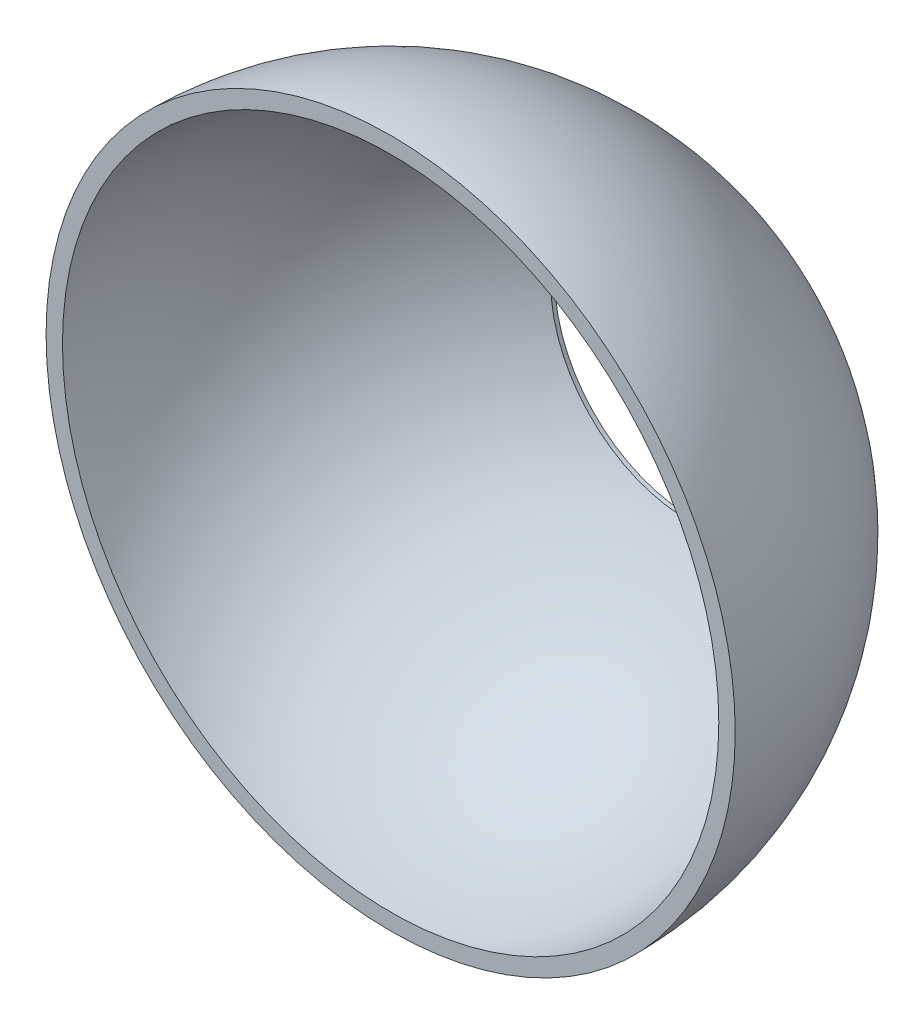
ISO-10303-21;
HEADER;
FILE_DESCRIPTION(('STEP AP214'),'2;1');
FILE_NAME('part.step','',(''),(''),'','','');
FILE_SCHEMA(('AUTOMOTIVE_DESIGN { 1 0 10303 214 1 1 1 1 }'));
ENDSEC;
DATA;
#1=APPLICATION_CONTEXT('core data for automotive mechanical design processes');
#2=APPLICATION_PROTOCOL_DEFINITION('international standard','automotive_design',2000,#1);
#3=PRODUCT_CONTEXT('',#1,'mechanical');
#4=PRODUCT('Part','Part','',(#3));
#5=PRODUCT_RELATED_PRODUCT_CATEGORY('part','',(#4));
#6=PRODUCT_DEFINITION_FORMATION('','',#4);
#7=PRODUCT_DEFINITION_CONTEXT('part definition',#1,'design');
#8=PRODUCT_DEFINITION('design','',#6,#7);
#9=PRODUCT_DEFINITION_SHAPE('','',#8);
#10=(LENGTH_UNIT() NAMED_UNIT(*) SI_UNIT(.MILLI.,.METRE.));
#11=(NAMED_UNIT(*) PLANE_ANGLE_UNIT() SI_UNIT($,.RADIAN.));
#12=(NAMED_UNIT(*) SI_UNIT($,.STERADIAN.) SOLID_ANGLE_UNIT());
#13=UNCERTAINTY_MEASURE_WITH_UNIT(LENGTH_MEASURE(1.E-05),#10,'distance_accuracy_value','');
#14=(GEOMETRIC_REPRESENTATION_CONTEXT(3) GLOBAL_UNCERTAINTY_ASSIGNED_CONTEXT((#13)) GLOBAL_UNIT_ASSIGNED_CONTEXT((#10,
#11,#12)) REPRESENTATION_CONTEXT('',''));
#15=CARTESIAN_POINT('',(0.,0.,0.));
#16=DIRECTION('',(0.,0.,1.));
#17=DIRECTION('',(1.,0.,0.));
#18=AXIS2_PLACEMENT_3D('',#15,#16,#17);
#19=CARTESIAN_POINT('',(0.,0.,0.));
#20=DIRECTION('',(0.,0.,1.));
#21=DIRECTION('',(1.,0.,0.));
#22=AXIS2_PLACEMENT_3D('',#19,#20,#21);
#23=SPHERICAL_SURFACE('',#22,10.5);
#24=CARTESIAN_POINT('',(0.,0.,-9.2));
#25=DIRECTION('',(0.,0.,1.));
#26=DIRECTION('',(1.,0.,0.));
#27=AXIS2_PLACEMENT_3D('',#24,#25,#26);
#28=CIRCLE('',#27,5.060632371552);
#29=CARTESIAN_POINT('',(5.060632371552,0.,-9.2));
#30=VERTEX_POINT('',#29);
#31=EDGE_CURVE('E10',#30,#30,#28,.T.);
#32=ORIENTED_EDGE('',*,*,#31,.T.);
#33=EDGE_LOOP('',(#32));
#34=FACE_BOUND('',#33,.T.);
#35=CARTESIAN_POINT('',(0.,0.,0.));
#36=DIRECTION('',(0.,0.,1.));
#37=DIRECTION('',(1.,0.,0.));
#38=AXIS2_PLACEMENT_3D('',#35,#36,#37);
#39=CIRCLE('',#38,10.5);
#40=CARTESIAN_POINT('',(10.5,0.,0.));
#41=VERTEX_POINT('',#40);
#42=EDGE_CURVE('E49',#41,#41,#39,.T.);
#43=ORIENTED_EDGE('',*,*,#42,.F.);
#44=EDGE_LOOP('',(#43));
#45=FACE_BOUND('',#44,.T.);
#46=ADVANCED_FACE('F30',(#34,#45),#23,.T.);
#47=CARTESIAN_POINT('',(5.060632371552,0.,-9.2));
#48=DIRECTION('',(0.,0.,-1.));
#49=DIRECTION('',(-1.,0.,0.));
#50=AXIS2_PLACEMENT_3D('',#47,#48,#49);
#51=PLANE('',#50);
#52=CARTESIAN_POINT('',(0.,0.,-9.2));
#53=DIRECTION('',(0.,0.,1.));
#54=DIRECTION('',(1.,0.,0.));
#55=AXIS2_PLACEMENT_3D('',#52,#53,#54);
#56=CIRCLE('',#55,4.2);
#57=CARTESIAN_POINT('',(4.2,0.,-9.2));
#58=VERTEX_POINT('',#57);
#59=EDGE_CURVE('E36',#58,#58,#56,.T.);
#60=ORIENTED_EDGE('',*,*,#59,.T.);
#61=EDGE_LOOP('',(#60));
#62=FACE_BOUND('',#61,.T.);
#63=ORIENTED_EDGE('',*,*,#31,.F.);
#64=EDGE_LOOP('',(#63));
#65=FACE_BOUND('',#64,.T.);
#66=ADVANCED_FACE('F57',(#62,#65),#51,.T.);
#67=CARTESIAN_POINT('',(0.,0.,0.));
#68=DIRECTION('',(0.,0.,1.));
#69=DIRECTION('',(1.,0.,0.));
#70=AXIS2_PLACEMENT_3D('',#67,#68,#69);
#71=CYLINDRICAL_SURFACE('',#70,4.2);
#72=CARTESIAN_POINT('',(0.,0.,-9.07524104363074));
#73=DIRECTION('',(0.,0.,1.));
#74=DIRECTION('',(1.,0.,0.));
#75=AXIS2_PLACEMENT_3D('',#72,#73,#74);
#76=CIRCLE('',#75,4.2);
#77=CARTESIAN_POINT('',(4.2,0.,-9.07524104363074));
#78=VERTEX_POINT('',#77);
#79=EDGE_CURVE('E40',#78,#78,#76,.T.);
#80=ORIENTED_EDGE('',*,*,#79,.T.);
#81=EDGE_LOOP('',(#80));
#82=FACE_BOUND('',#81,.T.);
#83=ORIENTED_EDGE('',*,*,#59,.F.);
#84=EDGE_LOOP('',(#83));
#85=FACE_BOUND('',#84,.T.);
#86=ADVANCED_FACE('F61',(#82,#85),#71,.F.);
#87=CARTESIAN_POINT('',(0.,0.,0.));
#88=DIRECTION('',(0.,0.,1.));
#89=DIRECTION('',(1.,0.,0.));
#90=AXIS2_PLACEMENT_3D('',#87,#88,#89);
#91=SPHERICAL_SURFACE('',#90,10.);
#92=CARTESIAN_POINT('',(0.,0.,0.));
#93=DIRECTION('',(0.,0.,1.));
#94=DIRECTION('',(1.,0.,0.));
#95=AXIS2_PLACEMENT_3D('',#92,#93,#94);
#96=CIRCLE('',#95,10.);
#97=CARTESIAN_POINT('',(10.,0.,0.));
#98=VERTEX_POINT('',#97);
#99=EDGE_CURVE('E44',#98,#98,#96,.T.);
#100=ORIENTED_EDGE('',*,*,#99,.T.);
#101=EDGE_LOOP('',(#100));
#102=FACE_BOUND('',#101,.T.);
#103=ORIENTED_EDGE('',*,*,#79,.F.);
#104=EDGE_LOOP('',(#103));
#105=FACE_BOUND('',#104,.T.);
#106=ADVANCED_FACE('F65',(#102,#105),#91,.F.);
#107=CARTESIAN_POINT('',(10.,0.,0.));
#108=DIRECTION('',(0.,0.,1.));
#109=DIRECTION('',(1.,0.,0.));
#110=AXIS2_PLACEMENT_3D('',#107,#108,#109);
#111=PLANE('',#110);
#112=ORIENTED_EDGE('',*,*,#42,.T.);
#113=EDGE_LOOP('',(#112));
#114=FACE_BOUND('',#113,.T.);
#115=ORIENTED_EDGE('',*,*,#99,.F.);
#116=EDGE_LOOP('',(#115));
#117=FACE_BOUND('',#116,.T.);
#118=ADVANCED_FACE('F53',(#114,#117),#111,.T.);
#119=CLOSED_SHELL('',(#46,#66,#86,#106,#118));
#120=MANIFOLD_SOLID_BREP('B2',#119);
#121=ADVANCED_BREP_SHAPE_REPRESENTATION('',(#18,#120),#14);
#122=SHAPE_DEFINITION_REPRESENTATION(#9,#121);
ENDSEC;
END-ISO-10303-21;
